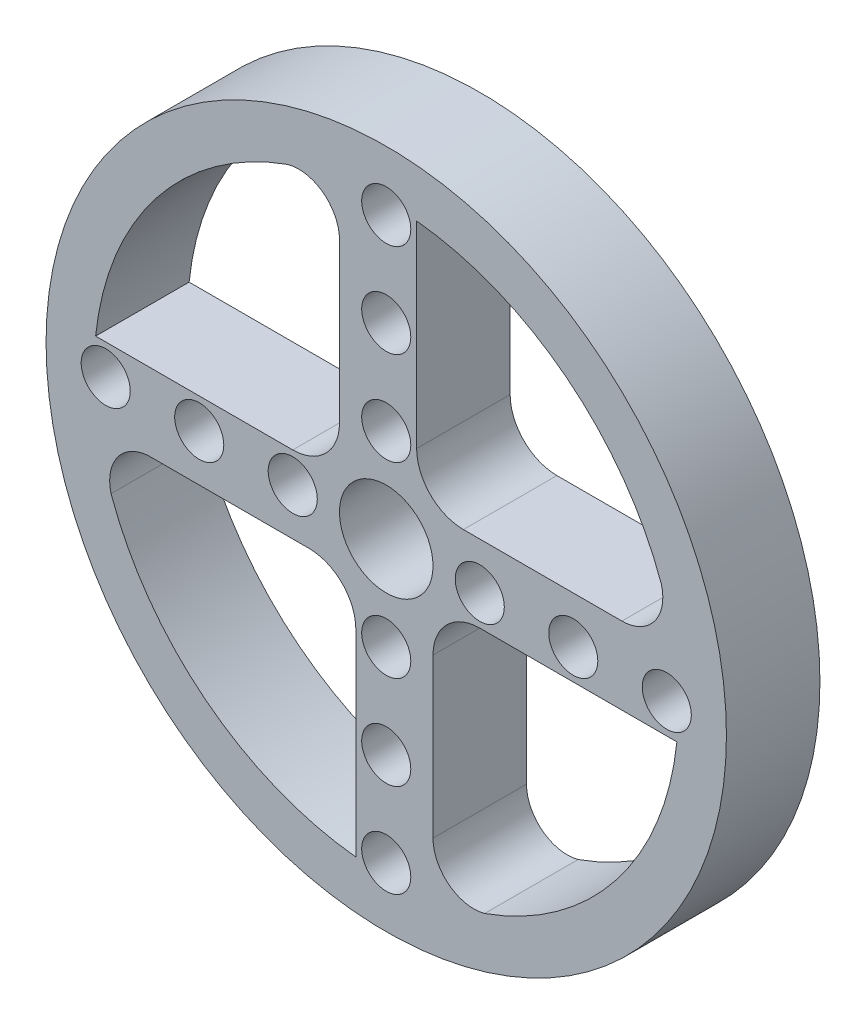
ISO-10303-21;
HEADER;
FILE_DESCRIPTION(('STEP AP214'),'2;1');
FILE_NAME('part.step','',(''),(''),'','','');
FILE_SCHEMA(('AUTOMOTIVE_DESIGN { 1 0 10303 214 1 1 1 1 }'));
ENDSEC;
DATA;
#1=APPLICATION_CONTEXT('core data for automotive mechanical design processes');
#2=APPLICATION_PROTOCOL_DEFINITION('international standard','automotive_design',2000,#1);
#3=PRODUCT_CONTEXT('',#1,'mechanical');
#4=PRODUCT('Part','Part','',(#3));
#5=PRODUCT_RELATED_PRODUCT_CATEGORY('part','',(#4));
#6=PRODUCT_DEFINITION_FORMATION('','',#4);
#7=PRODUCT_DEFINITION_CONTEXT('part definition',#1,'design');
#8=PRODUCT_DEFINITION('design','',#6,#7);
#9=PRODUCT_DEFINITION_SHAPE('','',#8);
#10=(LENGTH_UNIT() NAMED_UNIT(*) SI_UNIT(.MILLI.,.METRE.));
#11=(NAMED_UNIT(*) PLANE_ANGLE_UNIT() SI_UNIT($,.RADIAN.));
#12=(NAMED_UNIT(*) SI_UNIT($,.STERADIAN.) SOLID_ANGLE_UNIT());
#13=UNCERTAINTY_MEASURE_WITH_UNIT(LENGTH_MEASURE(1.E-05),#10,'distance_accuracy_value','');
#14=(GEOMETRIC_REPRESENTATION_CONTEXT(3) GLOBAL_UNCERTAINTY_ASSIGNED_CONTEXT((#13)) GLOBAL_UNIT_ASSIGNED_CONTEXT((#10,
#11,#12)) REPRESENTATION_CONTEXT('',''));
#15=CARTESIAN_POINT('',(0.,0.,0.));
#16=DIRECTION('',(0.,0.,1.));
#17=DIRECTION('',(1.,0.,0.));
#18=AXIS2_PLACEMENT_3D('',#15,#16,#17);
#19=CARTESIAN_POINT('',(0.,4.,8.));
#20=DIRECTION('',(0.,1.,0.));
#21=DIRECTION('',(-1.,0.,0.));
#22=AXIS2_PLACEMENT_3D('',#19,#20,#21);
#23=PLANE('',#22);
#24=DIRECTION('',(1.,0.,0.));
#25=VECTOR('',#24,1.);
#26=CARTESIAN_POINT('',(0.,4.,0.));
#27=LINE('',#26,#25);
#28=CARTESIAN_POINT('',(6.59999999999997,3.99999999999996,0.));
#29=VERTEX_POINT('',#28);
#30=CARTESIAN_POINT('',(20.1628902848437,3.99999999999986,0.));
#31=VERTEX_POINT('',#30);
#32=EDGE_CURVE('E334',#29,#31,#27,.T.);
#33=ORIENTED_EDGE('',*,*,#32,.F.);
#34=DIRECTION('',(0.,0.,-1.));
#35=VECTOR('',#34,1.);
#36=CARTESIAN_POINT('',(6.59999999999997,3.99999999999996,8.));
#37=LINE('',#36,#35);
#38=CARTESIAN_POINT('',(6.59999999999997,3.99999999999996,8.));
#39=VERTEX_POINT('',#38);
#40=EDGE_CURVE('E11',#39,#29,#37,.T.);
#41=ORIENTED_EDGE('',*,*,#40,.F.);
#42=DIRECTION('',(1.,0.,0.));
#43=VECTOR('',#42,1.);
#44=CARTESIAN_POINT('',(0.,4.,8.));
#45=LINE('',#44,#43);
#46=CARTESIAN_POINT('',(20.1628902848437,3.99999999999986,8.));
#47=VERTEX_POINT('',#46);
#48=EDGE_CURVE('E247',#39,#47,#45,.T.);
#49=ORIENTED_EDGE('',*,*,#48,.T.);
#50=DIRECTION('',(0.,0.,-1.));
#51=VECTOR('',#50,1.);
#52=CARTESIAN_POINT('',(20.1628902848437,3.99999999999986,8.));
#53=LINE('',#52,#51);
#54=EDGE_CURVE('E53',#47,#31,#53,.T.);
#55=ORIENTED_EDGE('',*,*,#54,.T.);
#56=EDGE_LOOP('',(#33,#41,#49,#55));
#57=FACE_BOUND('',#56,.T.);
#58=ADVANCED_FACE('F34',(#57),#23,.T.);
#59=CARTESIAN_POINT('',(6.6,8.00000000000002,8.));
#60=DIRECTION('',(0.,0.,-1.));
#61=DIRECTION('',(-1.,0.,0.));
#62=AXIS2_PLACEMENT_3D('',#59,#60,#61);
#63=CYLINDRICAL_SURFACE('',#62,4.);
#64=CARTESIAN_POINT('',(6.6,8.00000000000002,0.));
#65=DIRECTION('',(0.,0.,1.));
#66=DIRECTION('',(1.,0.,0.));
#67=AXIS2_PLACEMENT_3D('',#64,#65,#66);
#68=CIRCLE('',#67,4.);
#69=CARTESIAN_POINT('',(2.6,8.00000000000002,0.));
#70=VERTEX_POINT('',#69);
#71=EDGE_CURVE('E336',#70,#29,#68,.T.);
#72=ORIENTED_EDGE('',*,*,#71,.F.);
#73=DIRECTION('',(0.,0.,-1.));
#74=VECTOR('',#73,1.);
#75=CARTESIAN_POINT('',(2.6,8.00000000000002,8.));
#76=LINE('',#75,#74);
#77=CARTESIAN_POINT('',(2.6,8.00000000000002,8.));
#78=VERTEX_POINT('',#77);
#79=EDGE_CURVE('E44',#78,#70,#76,.T.);
#80=ORIENTED_EDGE('',*,*,#79,.F.);
#81=CARTESIAN_POINT('',(6.6,8.00000000000002,8.));
#82=DIRECTION('',(0.,0.,1.));
#83=DIRECTION('',(1.,0.,0.));
#84=AXIS2_PLACEMENT_3D('',#81,#82,#83);
#85=CIRCLE('',#84,4.);
#86=EDGE_CURVE('E197',#78,#39,#85,.T.);
#87=ORIENTED_EDGE('',*,*,#86,.T.);
#88=ORIENTED_EDGE('',*,*,#40,.T.);
#89=EDGE_LOOP('',(#72,#80,#87,#88));
#90=FACE_BOUND('',#89,.T.);
#91=ADVANCED_FACE('F456',(#90),#63,.F.);
#92=CARTESIAN_POINT('',(2.6,0.,8.));
#93=DIRECTION('',(1.,0.,0.));
#94=DIRECTION('',(0.,1.,0.));
#95=AXIS2_PLACEMENT_3D('',#92,#93,#94);
#96=PLANE('',#95);
#97=DIRECTION('',(0.,-1.,0.));
#98=VECTOR('',#97,1.);
#99=CARTESIAN_POINT('',(2.6,0.,0.));
#100=LINE('',#99,#98);
#101=CARTESIAN_POINT('',(2.59999999999953,24.8644324286766,0.));
#102=VERTEX_POINT('',#101);
#103=EDGE_CURVE('E183',#102,#70,#100,.T.);
#104=ORIENTED_EDGE('',*,*,#103,.F.);
#105=DIRECTION('',(0.,0.,-1.));
#106=VECTOR('',#105,1.);
#107=CARTESIAN_POINT('',(2.59999999999953,24.8644324286766,8.));
#108=LINE('',#107,#106);
#109=CARTESIAN_POINT('',(2.59999999999953,24.8644324286766,8.));
#110=VERTEX_POINT('',#109);
#111=EDGE_CURVE('E178',#110,#102,#108,.T.);
#112=ORIENTED_EDGE('',*,*,#111,.F.);
#113=DIRECTION('',(0.,-1.,0.));
#114=VECTOR('',#113,1.);
#115=CARTESIAN_POINT('',(2.6,0.,8.));
#116=LINE('',#115,#114);
#117=EDGE_CURVE('E181',#110,#78,#116,.T.);
#118=ORIENTED_EDGE('',*,*,#117,.T.);
#119=ORIENTED_EDGE('',*,*,#79,.T.);
#120=EDGE_LOOP('',(#104,#112,#118,#119));
#121=FACE_BOUND('',#120,.T.);
#122=ADVANCED_FACE('F180',(#121),#96,.T.);
#123=CARTESIAN_POINT('',(0.,0.,8.));
#124=DIRECTION('',(0.,0.,-1.));
#125=DIRECTION('',(-1.,0.,0.));
#126=AXIS2_PLACEMENT_3D('',#123,#124,#125);
#127=CYLINDRICAL_SURFACE('',#126,25.);
#128=CARTESIAN_POINT('',(0.,0.,0.));
#129=DIRECTION('',(0.,0.,1.));
#130=DIRECTION('',(1.,0.,0.));
#131=AXIS2_PLACEMENT_3D('',#128,#129,#130);
#132=CIRCLE('',#131,25.);
#133=CARTESIAN_POINT('',(23.5410982720302,8.41526542342064,0.));
#134=VERTEX_POINT('',#133);
#135=EDGE_CURVE('E305',#134,#102,#132,.T.);
#136=ORIENTED_EDGE('',*,*,#135,.F.);
#137=DIRECTION('',(0.,0.,-1.));
#138=VECTOR('',#137,1.);
#139=CARTESIAN_POINT('',(23.5410982720302,8.41526542342064,8.));
#140=LINE('',#139,#138);
#141=CARTESIAN_POINT('',(23.5410982720302,8.41526542342064,8.));
#142=VERTEX_POINT('',#141);
#143=EDGE_CURVE('E114',#142,#134,#140,.T.);
#144=ORIENTED_EDGE('',*,*,#143,.F.);
#145=CARTESIAN_POINT('',(0.,0.,8.));
#146=DIRECTION('',(0.,0.,1.));
#147=DIRECTION('',(1.,0.,0.));
#148=AXIS2_PLACEMENT_3D('',#145,#146,#147);
#149=CIRCLE('',#148,25.);
#150=EDGE_CURVE('E195',#142,#110,#149,.T.);
#151=ORIENTED_EDGE('',*,*,#150,.T.);
#152=ORIENTED_EDGE('',*,*,#111,.T.);
#153=EDGE_LOOP('',(#136,#144,#151,#152));
#154=FACE_BOUND('',#153,.T.);
#155=ADVANCED_FACE('F199',(#154),#127,.F.);
#156=CARTESIAN_POINT('',(-4.,0.,8.));
#157=DIRECTION('',(-1.,0.,0.));
#158=DIRECTION('',(0.,-1.,0.));
#159=AXIS2_PLACEMENT_3D('',#156,#157,#158);
#160=PLANE('',#159);
#161=DIRECTION('',(0.,1.,0.));
#162=VECTOR('',#161,1.);
#163=CARTESIAN_POINT('',(-4.,0.,0.));
#164=LINE('',#163,#162);
#165=CARTESIAN_POINT('',(-3.99999999999998,6.59999999999999,0.));
#166=VERTEX_POINT('',#165);
#167=CARTESIAN_POINT('',(-3.99999999999993,20.1628902848436,0.));
#168=VERTEX_POINT('',#167);
#169=EDGE_CURVE('E321',#166,#168,#164,.T.);
#170=ORIENTED_EDGE('',*,*,#169,.F.);
#171=DIRECTION('',(0.,0.,-1.));
#172=VECTOR('',#171,1.);
#173=CARTESIAN_POINT('',(-3.99999999999998,6.59999999999999,8.));
#174=LINE('',#173,#172);
#175=CARTESIAN_POINT('',(-3.99999999999998,6.59999999999999,8.));
#176=VERTEX_POINT('',#175);
#177=EDGE_CURVE('E387',#176,#166,#174,.T.);
#178=ORIENTED_EDGE('',*,*,#177,.F.);
#179=DIRECTION('',(0.,1.,0.));
#180=VECTOR('',#179,1.);
#181=CARTESIAN_POINT('',(-4.,0.,8.));
#182=LINE('',#181,#180);
#183=CARTESIAN_POINT('',(-3.99999999999993,20.1628902848436,8.));
#184=VERTEX_POINT('',#183);
#185=EDGE_CURVE('E227',#176,#184,#182,.T.);
#186=ORIENTED_EDGE('',*,*,#185,.T.);
#187=DIRECTION('',(0.,0.,-1.));
#188=VECTOR('',#187,1.);
#189=CARTESIAN_POINT('',(-3.99999999999993,20.1628902848436,8.));
#190=LINE('',#189,#188);
#191=EDGE_CURVE('E390',#184,#168,#190,.T.);
#192=ORIENTED_EDGE('',*,*,#191,.T.);
#193=EDGE_LOOP('',(#170,#178,#186,#192));
#194=FACE_BOUND('',#193,.T.);
#195=ADVANCED_FACE('F454',(#194),#160,.T.);
#196=CARTESIAN_POINT('',(-8.,6.6,8.));
#197=DIRECTION('',(0.,0.,-1.));
#198=DIRECTION('',(-1.,0.,0.));
#199=AXIS2_PLACEMENT_3D('',#196,#197,#198);
#200=CYLINDRICAL_SURFACE('',#199,4.);
#201=CARTESIAN_POINT('',(-8.,6.6,0.));
#202=DIRECTION('',(0.,0.,1.));
#203=DIRECTION('',(1.,0.,0.));
#204=AXIS2_PLACEMENT_3D('',#201,#202,#203);
#205=CIRCLE('',#204,4.);
#206=CARTESIAN_POINT('',(-8.,2.6,0.));
#207=VERTEX_POINT('',#206);
#208=EDGE_CURVE('E324',#207,#166,#205,.T.);
#209=ORIENTED_EDGE('',*,*,#208,.F.);
#210=DIRECTION('',(0.,0.,-1.));
#211=VECTOR('',#210,1.);
#212=CARTESIAN_POINT('',(-8.,2.6,8.));
#213=LINE('',#212,#211);
#214=CARTESIAN_POINT('',(-8.,2.6,8.));
#215=VERTEX_POINT('',#214);
#216=EDGE_CURVE('E397',#215,#207,#213,.T.);
#217=ORIENTED_EDGE('',*,*,#216,.F.);
#218=CARTESIAN_POINT('',(-8.,6.6,8.));
#219=DIRECTION('',(0.,0.,1.));
#220=DIRECTION('',(1.,0.,0.));
#221=AXIS2_PLACEMENT_3D('',#218,#219,#220);
#222=CIRCLE('',#221,4.);
#223=EDGE_CURVE('E240',#215,#176,#222,.T.);
#224=ORIENTED_EDGE('',*,*,#223,.T.);
#225=ORIENTED_EDGE('',*,*,#177,.T.);
#226=EDGE_LOOP('',(#209,#217,#224,#225));
#227=FACE_BOUND('',#226,.T.);
#228=ADVANCED_FACE('F473',(#227),#200,.F.);
#229=CARTESIAN_POINT('',(0.,2.6,8.));
#230=DIRECTION('',(0.,1.,0.));
#231=DIRECTION('',(0.,0.,1.));
#232=AXIS2_PLACEMENT_3D('',#229,#230,#231);
#233=PLANE('',#232);
#234=DIRECTION('',(1.,0.,0.));
#235=VECTOR('',#234,1.);
#236=CARTESIAN_POINT('',(0.,2.6,0.));
#237=LINE('',#236,#235);
#238=CARTESIAN_POINT('',(-24.8644324286766,2.59999999999954,0.));
#239=VERTEX_POINT('',#238);
#240=EDGE_CURVE('E327',#239,#207,#237,.T.);
#241=ORIENTED_EDGE('',*,*,#240,.F.);
#242=DIRECTION('',(0.,0.,-1.));
#243=VECTOR('',#242,1.);
#244=CARTESIAN_POINT('',(-24.8644324286766,2.59999999999954,8.));
#245=LINE('',#244,#243);
#246=CARTESIAN_POINT('',(-24.8644324286766,2.59999999999954,8.));
#247=VERTEX_POINT('',#246);
#248=EDGE_CURVE('E395',#247,#239,#245,.T.);
#249=ORIENTED_EDGE('',*,*,#248,.F.);
#250=DIRECTION('',(1.,0.,0.));
#251=VECTOR('',#250,1.);
#252=CARTESIAN_POINT('',(0.,2.6,8.));
#253=LINE('',#252,#251);
#254=EDGE_CURVE('E210',#247,#215,#253,.T.);
#255=ORIENTED_EDGE('',*,*,#254,.T.);
#256=ORIENTED_EDGE('',*,*,#216,.T.);
#257=EDGE_LOOP('',(#241,#249,#255,#256));
#258=FACE_BOUND('',#257,.T.);
#259=ADVANCED_FACE('F470',(#258),#233,.T.);
#260=CARTESIAN_POINT('',(-8.41526542342072,23.5410982720301,0.));
#261=VERTEX_POINT('',#260);
#262=EDGE_CURVE('E330',#261,#239,#132,.T.);
#263=ORIENTED_EDGE('',*,*,#262,.F.);
#264=DIRECTION('',(0.,0.,-1.));
#265=VECTOR('',#264,1.);
#266=CARTESIAN_POINT('',(-8.41526542342072,23.5410982720301,8.));
#267=LINE('',#266,#265);
#268=CARTESIAN_POINT('',(-8.41526542342072,23.5410982720301,8.));
#269=VERTEX_POINT('',#268);
#270=EDGE_CURVE('E392',#269,#261,#267,.T.);
#271=ORIENTED_EDGE('',*,*,#270,.F.);
#272=EDGE_CURVE('E202',#269,#247,#149,.T.);
#273=ORIENTED_EDGE('',*,*,#272,.T.);
#274=ORIENTED_EDGE('',*,*,#248,.T.);
#275=EDGE_LOOP('',(#263,#271,#273,#274));
#276=FACE_BOUND('',#275,.T.);
#277=ADVANCED_FACE('F452',(#276),#127,.F.);
#278=CARTESIAN_POINT('',(0.,-4.,8.));
#279=DIRECTION('',(0.,-1.,0.));
#280=DIRECTION('',(1.,0.,0.));
#281=AXIS2_PLACEMENT_3D('',#278,#279,#280);
#282=PLANE('',#281);
#283=DIRECTION('',(-1.,0.,0.));
#284=VECTOR('',#283,1.);
#285=CARTESIAN_POINT('',(0.,-4.,0.));
#286=LINE('',#285,#284);
#287=CARTESIAN_POINT('',(-6.59999999999998,-4.,0.));
#288=VERTEX_POINT('',#287);
#289=CARTESIAN_POINT('',(-20.1628902848436,-4.,0.));
#290=VERTEX_POINT('',#289);
#291=EDGE_CURVE('E309',#288,#290,#286,.T.);
#292=ORIENTED_EDGE('',*,*,#291,.F.);
#293=DIRECTION('',(0.,0.,-1.));
#294=VECTOR('',#293,1.);
#295=CARTESIAN_POINT('',(-6.59999999999998,-4.,8.));
#296=LINE('',#295,#294);
#297=CARTESIAN_POINT('',(-6.59999999999998,-4.,8.));
#298=VERTEX_POINT('',#297);
#299=EDGE_CURVE('E393',#298,#288,#296,.T.);
#300=ORIENTED_EDGE('',*,*,#299,.F.);
#301=DIRECTION('',(-1.,0.,0.));
#302=VECTOR('',#301,1.);
#303=CARTESIAN_POINT('',(0.,-4.,8.));
#304=LINE('',#303,#302);
#305=CARTESIAN_POINT('',(-20.1628902848436,-4.,8.));
#306=VERTEX_POINT('',#305);
#307=EDGE_CURVE('E218',#298,#306,#304,.T.);
#308=ORIENTED_EDGE('',*,*,#307,.T.);
#309=DIRECTION('',(0.,0.,-1.));
#310=VECTOR('',#309,1.);
#311=CARTESIAN_POINT('',(-20.1628902848436,-4.,8.));
#312=LINE('',#311,#310);
#313=EDGE_CURVE('E400',#306,#290,#312,.T.);
#314=ORIENTED_EDGE('',*,*,#313,.T.);
#315=EDGE_LOOP('',(#292,#300,#308,#314));
#316=FACE_BOUND('',#315,.T.);
#317=ADVANCED_FACE('F489',(#316),#282,.T.);
#318=CARTESIAN_POINT('',(-6.59999999999998,-8.,8.));
#319=DIRECTION('',(0.,0.,-1.));
#320=DIRECTION('',(-1.,0.,0.));
#321=AXIS2_PLACEMENT_3D('',#318,#319,#320);
#322=CYLINDRICAL_SURFACE('',#321,4.);
#323=CARTESIAN_POINT('',(-6.59999999999998,-8.,0.));
#324=DIRECTION('',(0.,0.,1.));
#325=DIRECTION('',(1.,0.,0.));
#326=AXIS2_PLACEMENT_3D('',#323,#324,#325);
#327=CIRCLE('',#326,4.);
#328=CARTESIAN_POINT('',(-2.59999999999998,-8.,0.));
#329=VERTEX_POINT('',#328);
#330=EDGE_CURVE('E312',#329,#288,#327,.T.);
#331=ORIENTED_EDGE('',*,*,#330,.F.);
#332=DIRECTION('',(0.,0.,-1.));
#333=VECTOR('',#332,1.);
#334=CARTESIAN_POINT('',(-2.59999999999998,-8.,8.));
#335=LINE('',#334,#333);
#336=CARTESIAN_POINT('',(-2.59999999999998,-8.,8.));
#337=VERTEX_POINT('',#336);
#338=EDGE_CURVE('E406',#337,#329,#335,.T.);
#339=ORIENTED_EDGE('',*,*,#338,.F.);
#340=CARTESIAN_POINT('',(-6.59999999999998,-8.,8.));
#341=DIRECTION('',(0.,0.,1.));
#342=DIRECTION('',(1.,0.,0.));
#343=AXIS2_PLACEMENT_3D('',#340,#341,#342);
#344=CIRCLE('',#343,4.);
#345=EDGE_CURVE('E230',#337,#298,#344,.T.);
#346=ORIENTED_EDGE('',*,*,#345,.T.);
#347=ORIENTED_EDGE('',*,*,#299,.T.);
#348=EDGE_LOOP('',(#331,#339,#346,#347));
#349=FACE_BOUND('',#348,.T.);
#350=ADVANCED_FACE('F486',(#349),#322,.F.);
#351=CARTESIAN_POINT('',(-2.59999999999998,0.,8.));
#352=DIRECTION('',(-1.,0.,0.));
#353=DIRECTION('',(0.,-1.,0.));
#354=AXIS2_PLACEMENT_3D('',#351,#352,#353);
#355=PLANE('',#354);
#356=DIRECTION('',(0.,1.,0.));
#357=VECTOR('',#356,1.);
#358=CARTESIAN_POINT('',(-2.59999999999998,0.,0.));
#359=LINE('',#358,#357);
#360=CARTESIAN_POINT('',(-2.59999999999951,-24.8644324286766,0.));
#361=VERTEX_POINT('',#360);
#362=EDGE_CURVE('E315',#361,#329,#359,.T.);
#363=ORIENTED_EDGE('',*,*,#362,.F.);
#364=DIRECTION('',(0.,0.,-1.));
#365=VECTOR('',#364,1.);
#366=CARTESIAN_POINT('',(-2.59999999999951,-24.8644324286766,8.));
#367=LINE('',#366,#365);
#368=CARTESIAN_POINT('',(-2.59999999999951,-24.8644324286766,8.));
#369=VERTEX_POINT('',#368);
#370=EDGE_CURVE('E404',#369,#361,#367,.T.);
#371=ORIENTED_EDGE('',*,*,#370,.F.);
#372=DIRECTION('',(0.,1.,0.));
#373=VECTOR('',#372,1.);
#374=CARTESIAN_POINT('',(-2.59999999999998,0.,8.));
#375=LINE('',#374,#373);
#376=EDGE_CURVE('E223',#369,#337,#375,.T.);
#377=ORIENTED_EDGE('',*,*,#376,.T.);
#378=ORIENTED_EDGE('',*,*,#338,.T.);
#379=EDGE_LOOP('',(#363,#371,#377,#378));
#380=FACE_BOUND('',#379,.T.);
#381=ADVANCED_FACE('F451',(#380),#355,.T.);
#382=CARTESIAN_POINT('',(-23.5410982720301,-8.4152654234208,0.));
#383=VERTEX_POINT('',#382);
#384=EDGE_CURVE('E306',#383,#361,#132,.T.);
#385=ORIENTED_EDGE('',*,*,#384,.F.);
#386=DIRECTION('',(0.,0.,-1.));
#387=VECTOR('',#386,1.);
#388=CARTESIAN_POINT('',(-23.5410982720301,-8.4152654234208,8.));
#389=LINE('',#388,#387);
#390=CARTESIAN_POINT('',(-23.5410982720301,-8.4152654234208,8.));
#391=VERTEX_POINT('',#390);
#392=EDGE_CURVE('E402',#391,#383,#389,.T.);
#393=ORIENTED_EDGE('',*,*,#392,.F.);
#394=EDGE_CURVE('E211',#391,#369,#149,.T.);
#395=ORIENTED_EDGE('',*,*,#394,.T.);
#396=ORIENTED_EDGE('',*,*,#370,.T.);
#397=EDGE_LOOP('',(#385,#393,#395,#396));
#398=FACE_BOUND('',#397,.T.);
#399=ADVANCED_FACE('F439',(#398),#127,.F.);
#400=CARTESIAN_POINT('',(4.,0.,8.));
#401=DIRECTION('',(1.,0.,0.));
#402=DIRECTION('',(0.,1.,0.));
#403=AXIS2_PLACEMENT_3D('',#400,#401,#402);
#404=PLANE('',#403);
#405=DIRECTION('',(0.,-1.,0.));
#406=VECTOR('',#405,1.);
#407=CARTESIAN_POINT('',(4.,0.,0.));
#408=LINE('',#407,#406);
#409=CARTESIAN_POINT('',(3.99999999999993,-6.59999999999993,0.));
#410=VERTEX_POINT('',#409);
#411=CARTESIAN_POINT('',(3.99999999999979,-20.1628902848437,0.));
#412=VERTEX_POINT('',#411);
#413=EDGE_CURVE('E292',#410,#412,#408,.T.);
#414=ORIENTED_EDGE('',*,*,#413,.F.);
#415=DIRECTION('',(0.,0.,-1.));
#416=VECTOR('',#415,1.);
#417=CARTESIAN_POINT('',(3.99999999999993,-6.59999999999993,8.));
#418=LINE('',#417,#416);
#419=CARTESIAN_POINT('',(3.99999999999993,-6.59999999999993,8.));
#420=VERTEX_POINT('',#419);
#421=EDGE_CURVE('E38',#420,#410,#418,.T.);
#422=ORIENTED_EDGE('',*,*,#421,.F.);
#423=DIRECTION('',(0.,-1.,0.));
#424=VECTOR('',#423,1.);
#425=CARTESIAN_POINT('',(4.,0.,8.));
#426=LINE('',#425,#424);
#427=CARTESIAN_POINT('',(3.99999999999979,-20.1628902848437,8.));
#428=VERTEX_POINT('',#427);
#429=EDGE_CURVE('E385',#420,#428,#426,.T.);
#430=ORIENTED_EDGE('',*,*,#429,.T.);
#431=DIRECTION('',(0.,0.,-1.));
#432=VECTOR('',#431,1.);
#433=CARTESIAN_POINT('',(3.99999999999979,-20.1628902848437,8.));
#434=LINE('',#433,#432);
#435=EDGE_CURVE('E291',#428,#412,#434,.T.);
#436=ORIENTED_EDGE('',*,*,#435,.T.);
#437=EDGE_LOOP('',(#414,#422,#430,#436));
#438=FACE_BOUND('',#437,.T.);
#439=ADVANCED_FACE('F36',(#438),#404,.T.);
#440=CARTESIAN_POINT('',(8.00000000000002,-6.59999999999997,8.));
#441=DIRECTION('',(0.,0.,-1.));
#442=DIRECTION('',(-1.,0.,0.));
#443=AXIS2_PLACEMENT_3D('',#440,#441,#442);
#444=CYLINDRICAL_SURFACE('',#443,4.);
#445=CARTESIAN_POINT('',(8.00000000000002,-6.59999999999997,0.));
#446=DIRECTION('',(0.,0.,1.));
#447=DIRECTION('',(1.,0.,0.));
#448=AXIS2_PLACEMENT_3D('',#445,#446,#447);
#449=CIRCLE('',#448,4.);
#450=CARTESIAN_POINT('',(8.00000000000002,-2.59999999999997,0.));
#451=VERTEX_POINT('',#450);
#452=EDGE_CURVE('E295',#451,#410,#449,.T.);
#453=ORIENTED_EDGE('',*,*,#452,.F.);
#454=DIRECTION('',(0.,0.,-1.));
#455=VECTOR('',#454,1.);
#456=CARTESIAN_POINT('',(8.00000000000002,-2.59999999999997,8.));
#457=LINE('',#456,#455);
#458=CARTESIAN_POINT('',(8.00000000000002,-2.59999999999997,8.));
#459=VERTEX_POINT('',#458);
#460=EDGE_CURVE('E413',#459,#451,#457,.T.);
#461=ORIENTED_EDGE('',*,*,#460,.F.);
#462=CARTESIAN_POINT('',(8.00000000000002,-6.59999999999997,8.));
#463=DIRECTION('',(0.,0.,1.));
#464=DIRECTION('',(1.,0.,0.));
#465=AXIS2_PLACEMENT_3D('',#462,#463,#464);
#466=CIRCLE('',#465,4.);
#467=EDGE_CURVE('E220',#459,#420,#466,.T.);
#468=ORIENTED_EDGE('',*,*,#467,.T.);
#469=ORIENTED_EDGE('',*,*,#421,.T.);
#470=EDGE_LOOP('',(#453,#461,#468,#469));
#471=FACE_BOUND('',#470,.T.);
#472=ADVANCED_FACE('F419',(#471),#444,.F.);
#473=CARTESIAN_POINT('',(0.,-2.59999999999998,8.));
#474=DIRECTION('',(0.,-1.,0.));
#475=DIRECTION('',(1.,0.,0.));
#476=AXIS2_PLACEMENT_3D('',#473,#474,#475);
#477=PLANE('',#476);
#478=DIRECTION('',(-1.,0.,0.));
#479=VECTOR('',#478,1.);
#480=CARTESIAN_POINT('',(0.,-2.59999999999998,0.));
#481=LINE('',#480,#479);
#482=CARTESIAN_POINT('',(24.8644324286766,-2.59999999999951,0.));
#483=VERTEX_POINT('',#482);
#484=EDGE_CURVE('E298',#483,#451,#481,.T.);
#485=ORIENTED_EDGE('',*,*,#484,.F.);
#486=DIRECTION('',(0.,0.,-1.));
#487=VECTOR('',#486,1.);
#488=CARTESIAN_POINT('',(24.8644324286766,-2.59999999999951,8.));
#489=LINE('',#488,#487);
#490=CARTESIAN_POINT('',(24.8644324286766,-2.59999999999951,8.));
#491=VERTEX_POINT('',#490);
#492=EDGE_CURVE('E412',#491,#483,#489,.T.);
#493=ORIENTED_EDGE('',*,*,#492,.F.);
#494=DIRECTION('',(-1.,0.,0.));
#495=VECTOR('',#494,1.);
#496=CARTESIAN_POINT('',(0.,-2.59999999999998,8.));
#497=LINE('',#496,#495);
#498=EDGE_CURVE('E214',#491,#459,#497,.T.);
#499=ORIENTED_EDGE('',*,*,#498,.T.);
#500=ORIENTED_EDGE('',*,*,#460,.T.);
#501=EDGE_LOOP('',(#485,#493,#499,#500));
#502=FACE_BOUND('',#501,.T.);
#503=ADVANCED_FACE('F426',(#502),#477,.T.);
#504=CARTESIAN_POINT('',(8.41526542342056,-23.5410982720302,0.));
#505=VERTEX_POINT('',#504);
#506=EDGE_CURVE('E301',#505,#483,#132,.T.);
#507=ORIENTED_EDGE('',*,*,#506,.F.);
#508=DIRECTION('',(0.,0.,-1.));
#509=VECTOR('',#508,1.);
#510=CARTESIAN_POINT('',(8.41526542342056,-23.5410982720302,8.));
#511=LINE('',#510,#509);
#512=CARTESIAN_POINT('',(8.41526542342056,-23.5410982720302,8.));
#513=VERTEX_POINT('',#512);
#514=EDGE_CURVE('E410',#513,#505,#511,.T.);
#515=ORIENTED_EDGE('',*,*,#514,.F.);
#516=EDGE_CURVE('E203',#513,#491,#149,.T.);
#517=ORIENTED_EDGE('',*,*,#516,.T.);
#518=ORIENTED_EDGE('',*,*,#492,.T.);
#519=EDGE_LOOP('',(#507,#515,#517,#518));
#520=FACE_BOUND('',#519,.T.);
#521=ADVANCED_FACE('F435',(#520),#127,.F.);
#522=CARTESIAN_POINT('',(8.,0.,8.));
#523=DIRECTION('',(0.,0.,-1.));
#524=DIRECTION('',(-1.,0.,0.));
#525=AXIS2_PLACEMENT_3D('',#522,#523,#524);
#526=CYLINDRICAL_SURFACE('',#525,2.1);
#527=CARTESIAN_POINT('',(8.,0.,8.));
#528=DIRECTION('',(0.,0.,1.));
#529=DIRECTION('',(1.,0.,0.));
#530=AXIS2_PLACEMENT_3D('',#527,#528,#529);
#531=CIRCLE('',#530,2.1);
#532=CARTESIAN_POINT('',(10.1,0.,8.));
#533=VERTEX_POINT('',#532);
#534=EDGE_CURVE('E285',#533,#533,#531,.T.);
#535=ORIENTED_EDGE('',*,*,#534,.T.);
#536=EDGE_LOOP('',(#535));
#537=FACE_BOUND('',#536,.T.);
#538=CARTESIAN_POINT('',(8.,0.,0.));
#539=DIRECTION('',(0.,0.,1.));
#540=DIRECTION('',(1.,0.,0.));
#541=AXIS2_PLACEMENT_3D('',#538,#539,#540);
#542=CIRCLE('',#541,2.1);
#543=CARTESIAN_POINT('',(10.1,0.,0.));
#544=VERTEX_POINT('',#543);
#545=EDGE_CURVE('E379',#544,#544,#542,.T.);
#546=ORIENTED_EDGE('',*,*,#545,.F.);
#547=EDGE_LOOP('',(#546));
#548=FACE_BOUND('',#547,.T.);
#549=ADVANCED_FACE('F437',(#537,#548),#526,.F.);
#550=CARTESIAN_POINT('',(0.,-8.,8.));
#551=DIRECTION('',(0.,0.,-1.));
#552=DIRECTION('',(-1.,0.,0.));
#553=AXIS2_PLACEMENT_3D('',#550,#551,#552);
#554=CYLINDRICAL_SURFACE('',#553,2.1);
#555=CARTESIAN_POINT('',(0.,-8.,8.));
#556=DIRECTION('',(0.,0.,1.));
#557=DIRECTION('',(1.,0.,0.));
#558=AXIS2_PLACEMENT_3D('',#555,#556,#557);
#559=CIRCLE('',#558,2.1);
#560=CARTESIAN_POINT('',(2.1,-8.,8.));
#561=VERTEX_POINT('',#560);
#562=EDGE_CURVE('E282',#561,#561,#559,.T.);
#563=ORIENTED_EDGE('',*,*,#562,.T.);
#564=EDGE_LOOP('',(#563));
#565=FACE_BOUND('',#564,.T.);
#566=CARTESIAN_POINT('',(0.,-8.,0.));
#567=DIRECTION('',(0.,0.,1.));
#568=DIRECTION('',(1.,0.,0.));
#569=AXIS2_PLACEMENT_3D('',#566,#567,#568);
#570=CIRCLE('',#569,2.1);
#571=CARTESIAN_POINT('',(2.1,-8.,0.));
#572=VERTEX_POINT('',#571);
#573=EDGE_CURVE('E376',#572,#572,#570,.T.);
#574=ORIENTED_EDGE('',*,*,#573,.F.);
#575=EDGE_LOOP('',(#574));
#576=FACE_BOUND('',#575,.T.);
#577=ADVANCED_FACE('F444',(#565,#576),#554,.F.);
#578=CARTESIAN_POINT('',(0.,-16.,8.));
#579=DIRECTION('',(0.,0.,-1.));
#580=DIRECTION('',(-1.,0.,0.));
#581=AXIS2_PLACEMENT_3D('',#578,#579,#580);
#582=CYLINDRICAL_SURFACE('',#581,2.1);
#583=CARTESIAN_POINT('',(0.,-16.,8.));
#584=DIRECTION('',(0.,0.,1.));
#585=DIRECTION('',(1.,0.,0.));
#586=AXIS2_PLACEMENT_3D('',#583,#584,#585);
#587=CIRCLE('',#586,2.1);
#588=CARTESIAN_POINT('',(2.1,-16.,8.));
#589=VERTEX_POINT('',#588);
#590=EDGE_CURVE('E279',#589,#589,#587,.T.);
#591=ORIENTED_EDGE('',*,*,#590,.T.);
#592=EDGE_LOOP('',(#591));
#593=FACE_BOUND('',#592,.T.);
#594=CARTESIAN_POINT('',(0.,-16.,0.));
#595=DIRECTION('',(0.,0.,1.));
#596=DIRECTION('',(1.,0.,0.));
#597=AXIS2_PLACEMENT_3D('',#594,#595,#596);
#598=CIRCLE('',#597,2.1);
#599=CARTESIAN_POINT('',(2.1,-16.,0.));
#600=VERTEX_POINT('',#599);
#601=EDGE_CURVE('E373',#600,#600,#598,.T.);
#602=ORIENTED_EDGE('',*,*,#601,.F.);
#603=EDGE_LOOP('',(#602));
#604=FACE_BOUND('',#603,.T.);
#605=ADVANCED_FACE('F603',(#593,#604),#582,.F.);
#606=CARTESIAN_POINT('',(0.,16.,8.));
#607=DIRECTION('',(0.,0.,-1.));
#608=DIRECTION('',(-1.,0.,0.));
#609=AXIS2_PLACEMENT_3D('',#606,#607,#608);
#610=CYLINDRICAL_SURFACE('',#609,2.1);
#611=CARTESIAN_POINT('',(0.,16.,8.));
#612=DIRECTION('',(0.,0.,1.));
#613=DIRECTION('',(1.,0.,0.));
#614=AXIS2_PLACEMENT_3D('',#611,#612,#613);
#615=CIRCLE('',#614,2.1);
#616=CARTESIAN_POINT('',(2.1,16.,8.));
#617=VERTEX_POINT('',#616);
#618=EDGE_CURVE('E276',#617,#617,#615,.T.);
#619=ORIENTED_EDGE('',*,*,#618,.T.);
#620=EDGE_LOOP('',(#619));
#621=FACE_BOUND('',#620,.T.);
#622=CARTESIAN_POINT('',(0.,16.,0.));
#623=DIRECTION('',(0.,0.,1.));
#624=DIRECTION('',(1.,0.,0.));
#625=AXIS2_PLACEMENT_3D('',#622,#623,#624);
#626=CIRCLE('',#625,2.1);
#627=CARTESIAN_POINT('',(2.1,16.,0.));
#628=VERTEX_POINT('',#627);
#629=EDGE_CURVE('E370',#628,#628,#626,.T.);
#630=ORIENTED_EDGE('',*,*,#629,.F.);
#631=EDGE_LOOP('',(#630));
#632=FACE_BOUND('',#631,.T.);
#633=ADVANCED_FACE('F612',(#621,#632),#610,.F.);
#634=CARTESIAN_POINT('',(0.,8.,8.));
#635=DIRECTION('',(0.,0.,-1.));
#636=DIRECTION('',(-1.,0.,0.));
#637=AXIS2_PLACEMENT_3D('',#634,#635,#636);
#638=CYLINDRICAL_SURFACE('',#637,2.1);
#639=CARTESIAN_POINT('',(0.,8.,8.));
#640=DIRECTION('',(0.,0.,1.));
#641=DIRECTION('',(1.,0.,0.));
#642=AXIS2_PLACEMENT_3D('',#639,#640,#641);
#643=CIRCLE('',#642,2.1);
#644=CARTESIAN_POINT('',(2.1,8.,8.));
#645=VERTEX_POINT('',#644);
#646=EDGE_CURVE('E273',#645,#645,#643,.T.);
#647=ORIENTED_EDGE('',*,*,#646,.T.);
#648=EDGE_LOOP('',(#647));
#649=FACE_BOUND('',#648,.T.);
#650=CARTESIAN_POINT('',(0.,8.,0.));
#651=DIRECTION('',(0.,0.,1.));
#652=DIRECTION('',(1.,0.,0.));
#653=AXIS2_PLACEMENT_3D('',#650,#651,#652);
#654=CIRCLE('',#653,2.1);
#655=CARTESIAN_POINT('',(2.1,8.,0.));
#656=VERTEX_POINT('',#655);
#657=EDGE_CURVE('E367',#656,#656,#654,.T.);
#658=ORIENTED_EDGE('',*,*,#657,.F.);
#659=EDGE_LOOP('',(#658));
#660=FACE_BOUND('',#659,.T.);
#661=ADVANCED_FACE('F621',(#649,#660),#638,.F.);
#662=CARTESIAN_POINT('',(-16.,0.,8.));
#663=DIRECTION('',(0.,0.,-1.));
#664=DIRECTION('',(-1.,0.,0.));
#665=AXIS2_PLACEMENT_3D('',#662,#663,#664);
#666=CYLINDRICAL_SURFACE('',#665,2.1);
#667=CARTESIAN_POINT('',(-16.,0.,8.));
#668=DIRECTION('',(0.,0.,1.));
#669=DIRECTION('',(1.,0.,0.));
#670=AXIS2_PLACEMENT_3D('',#667,#668,#669);
#671=CIRCLE('',#670,2.1);
#672=CARTESIAN_POINT('',(-13.9,0.,8.));
#673=VERTEX_POINT('',#672);
#674=EDGE_CURVE('E270',#673,#673,#671,.T.);
#675=ORIENTED_EDGE('',*,*,#674,.T.);
#676=EDGE_LOOP('',(#675));
#677=FACE_BOUND('',#676,.T.);
#678=CARTESIAN_POINT('',(-16.,0.,0.));
#679=DIRECTION('',(0.,0.,1.));
#680=DIRECTION('',(1.,0.,0.));
#681=AXIS2_PLACEMENT_3D('',#678,#679,#680);
#682=CIRCLE('',#681,2.1);
#683=CARTESIAN_POINT('',(-13.9,0.,0.));
#684=VERTEX_POINT('',#683);
#685=EDGE_CURVE('E364',#684,#684,#682,.T.);
#686=ORIENTED_EDGE('',*,*,#685,.F.);
#687=EDGE_LOOP('',(#686));
#688=FACE_BOUND('',#687,.T.);
#689=ADVANCED_FACE('F630',(#677,#688),#666,.F.);
#690=CARTESIAN_POINT('',(-8.,0.,8.));
#691=DIRECTION('',(0.,0.,-1.));
#692=DIRECTION('',(-1.,0.,0.));
#693=AXIS2_PLACEMENT_3D('',#690,#691,#692);
#694=CYLINDRICAL_SURFACE('',#693,2.1);
#695=CARTESIAN_POINT('',(-8.,0.,8.));
#696=DIRECTION('',(0.,0.,1.));
#697=DIRECTION('',(1.,0.,0.));
#698=AXIS2_PLACEMENT_3D('',#695,#696,#697);
#699=CIRCLE('',#698,2.1);
#700=CARTESIAN_POINT('',(-5.9,0.,8.));
#701=VERTEX_POINT('',#700);
#702=EDGE_CURVE('E267',#701,#701,#699,.T.);
#703=ORIENTED_EDGE('',*,*,#702,.T.);
#704=EDGE_LOOP('',(#703));
#705=FACE_BOUND('',#704,.T.);
#706=CARTESIAN_POINT('',(-8.,0.,0.));
#707=DIRECTION('',(0.,0.,1.));
#708=DIRECTION('',(1.,0.,0.));
#709=AXIS2_PLACEMENT_3D('',#706,#707,#708);
#710=CIRCLE('',#709,2.1);
#711=CARTESIAN_POINT('',(-5.9,0.,0.));
#712=VERTEX_POINT('',#711);
#713=EDGE_CURVE('E361',#712,#712,#710,.T.);
#714=ORIENTED_EDGE('',*,*,#713,.F.);
#715=EDGE_LOOP('',(#714));
#716=FACE_BOUND('',#715,.T.);
#717=ADVANCED_FACE('F639',(#705,#716),#694,.F.);
#718=CARTESIAN_POINT('',(0.,0.,8.));
#719=DIRECTION('',(0.,0.,-1.));
#720=DIRECTION('',(-1.,0.,0.));
#721=AXIS2_PLACEMENT_3D('',#718,#719,#720);
#722=CYLINDRICAL_SURFACE('',#721,29.105);
#723=CARTESIAN_POINT('',(0.,0.,8.));
#724=DIRECTION('',(0.,0.,1.));
#725=DIRECTION('',(1.,0.,0.));
#726=AXIS2_PLACEMENT_3D('',#723,#724,#725);
#727=CIRCLE('',#726,29.105);
#728=CARTESIAN_POINT('',(29.105,0.,8.));
#729=VERTEX_POINT('',#728);
#730=EDGE_CURVE('E264',#729,#729,#727,.T.);
#731=ORIENTED_EDGE('',*,*,#730,.F.);
#732=EDGE_LOOP('',(#731));
#733=FACE_BOUND('',#732,.T.);
#734=CARTESIAN_POINT('',(0.,0.,0.));
#735=DIRECTION('',(0.,0.,1.));
#736=DIRECTION('',(1.,0.,0.));
#737=AXIS2_PLACEMENT_3D('',#734,#735,#736);
#738=CIRCLE('',#737,29.105);
#739=CARTESIAN_POINT('',(29.105,0.,0.));
#740=VERTEX_POINT('',#739);
#741=EDGE_CURVE('E358',#740,#740,#738,.T.);
#742=ORIENTED_EDGE('',*,*,#741,.T.);
#743=EDGE_LOOP('',(#742));
#744=FACE_BOUND('',#743,.T.);
#745=ADVANCED_FACE('F648',(#733,#744),#722,.T.);
#746=CARTESIAN_POINT('',(-24.,0.,8.));
#747=DIRECTION('',(0.,0.,-1.));
#748=DIRECTION('',(-1.,0.,0.));
#749=AXIS2_PLACEMENT_3D('',#746,#747,#748);
#750=CYLINDRICAL_SURFACE('',#749,2.1);
#751=CARTESIAN_POINT('',(-24.,0.,8.));
#752=DIRECTION('',(0.,0.,1.));
#753=DIRECTION('',(1.,0.,0.));
#754=AXIS2_PLACEMENT_3D('',#751,#752,#753);
#755=CIRCLE('',#754,2.1);
#756=CARTESIAN_POINT('',(-21.9,0.,8.));
#757=VERTEX_POINT('',#756);
#758=EDGE_CURVE('E261',#757,#757,#755,.T.);
#759=ORIENTED_EDGE('',*,*,#758,.T.);
#760=EDGE_LOOP('',(#759));
#761=FACE_BOUND('',#760,.T.);
#762=CARTESIAN_POINT('',(-24.,0.,0.));
#763=DIRECTION('',(0.,0.,1.));
#764=DIRECTION('',(1.,0.,0.));
#765=AXIS2_PLACEMENT_3D('',#762,#763,#764);
#766=CIRCLE('',#765,2.1);
#767=CARTESIAN_POINT('',(-21.9,0.,0.));
#768=VERTEX_POINT('',#767);
#769=EDGE_CURVE('E355',#768,#768,#766,.T.);
#770=ORIENTED_EDGE('',*,*,#769,.F.);
#771=EDGE_LOOP('',(#770));
#772=FACE_BOUND('',#771,.T.);
#773=ADVANCED_FACE('F657',(#761,#772),#750,.F.);
#774=CARTESIAN_POINT('',(0.,-24.,8.));
#775=DIRECTION('',(0.,0.,-1.));
#776=DIRECTION('',(-1.,0.,0.));
#777=AXIS2_PLACEMENT_3D('',#774,#775,#776);
#778=CYLINDRICAL_SURFACE('',#777,2.1);
#779=CARTESIAN_POINT('',(0.,-24.,8.));
#780=DIRECTION('',(0.,0.,1.));
#781=DIRECTION('',(1.,0.,0.));
#782=AXIS2_PLACEMENT_3D('',#779,#780,#781);
#783=CIRCLE('',#782,2.1);
#784=CARTESIAN_POINT('',(2.1,-24.,8.));
#785=VERTEX_POINT('',#784);
#786=EDGE_CURVE('E258',#785,#785,#783,.T.);
#787=ORIENTED_EDGE('',*,*,#786,.T.);
#788=EDGE_LOOP('',(#787));
#789=FACE_BOUND('',#788,.T.);
#790=CARTESIAN_POINT('',(0.,-24.,0.));
#791=DIRECTION('',(0.,0.,1.));
#792=DIRECTION('',(1.,0.,0.));
#793=AXIS2_PLACEMENT_3D('',#790,#791,#792);
#794=CIRCLE('',#793,2.1);
#795=CARTESIAN_POINT('',(2.1,-24.,0.));
#796=VERTEX_POINT('',#795);
#797=EDGE_CURVE('E352',#796,#796,#794,.T.);
#798=ORIENTED_EDGE('',*,*,#797,.F.);
#799=EDGE_LOOP('',(#798));
#800=FACE_BOUND('',#799,.T.);
#801=ADVANCED_FACE('F666',(#789,#800),#778,.F.);
#802=CARTESIAN_POINT('',(24.,0.,8.));
#803=DIRECTION('',(0.,0.,-1.));
#804=DIRECTION('',(-1.,0.,0.));
#805=AXIS2_PLACEMENT_3D('',#802,#803,#804);
#806=CYLINDRICAL_SURFACE('',#805,2.1);
#807=CARTESIAN_POINT('',(24.,0.,8.));
#808=DIRECTION('',(0.,0.,1.));
#809=DIRECTION('',(1.,0.,0.));
#810=AXIS2_PLACEMENT_3D('',#807,#808,#809);
#811=CIRCLE('',#810,2.1);
#812=CARTESIAN_POINT('',(26.1,0.,8.));
#813=VERTEX_POINT('',#812);
#814=EDGE_CURVE('E255',#813,#813,#811,.T.);
#815=ORIENTED_EDGE('',*,*,#814,.T.);
#816=EDGE_LOOP('',(#815));
#817=FACE_BOUND('',#816,.T.);
#818=CARTESIAN_POINT('',(24.,0.,0.));
#819=DIRECTION('',(0.,0.,1.));
#820=DIRECTION('',(1.,0.,0.));
#821=AXIS2_PLACEMENT_3D('',#818,#819,#820);
#822=CIRCLE('',#821,2.1);
#823=CARTESIAN_POINT('',(26.1,0.,0.));
#824=VERTEX_POINT('',#823);
#825=EDGE_CURVE('E349',#824,#824,#822,.T.);
#826=ORIENTED_EDGE('',*,*,#825,.F.);
#827=EDGE_LOOP('',(#826));
#828=FACE_BOUND('',#827,.T.);
#829=ADVANCED_FACE('F675',(#817,#828),#806,.F.);
#830=CARTESIAN_POINT('',(0.,24.,8.));
#831=DIRECTION('',(0.,0.,-1.));
#832=DIRECTION('',(-1.,0.,0.));
#833=AXIS2_PLACEMENT_3D('',#830,#831,#832);
#834=CYLINDRICAL_SURFACE('',#833,2.1);
#835=CARTESIAN_POINT('',(0.,24.,8.));
#836=DIRECTION('',(0.,0.,1.));
#837=DIRECTION('',(1.,0.,0.));
#838=AXIS2_PLACEMENT_3D('',#835,#836,#837);
#839=CIRCLE('',#838,2.1);
#840=CARTESIAN_POINT('',(2.1,24.,8.));
#841=VERTEX_POINT('',#840);
#842=EDGE_CURVE('E252',#841,#841,#839,.T.);
#843=ORIENTED_EDGE('',*,*,#842,.T.);
#844=EDGE_LOOP('',(#843));
#845=FACE_BOUND('',#844,.T.);
#846=CARTESIAN_POINT('',(0.,24.,0.));
#847=DIRECTION('',(0.,0.,1.));
#848=DIRECTION('',(1.,0.,0.));
#849=AXIS2_PLACEMENT_3D('',#846,#847,#848);
#850=CIRCLE('',#849,2.1);
#851=CARTESIAN_POINT('',(2.1,24.,0.));
#852=VERTEX_POINT('',#851);
#853=EDGE_CURVE('E346',#852,#852,#850,.T.);
#854=ORIENTED_EDGE('',*,*,#853,.F.);
#855=EDGE_LOOP('',(#854));
#856=FACE_BOUND('',#855,.T.);
#857=ADVANCED_FACE('F684',(#845,#856),#834,.F.);
#858=CARTESIAN_POINT('',(0.,0.,8.));
#859=DIRECTION('',(0.,0.,-1.));
#860=DIRECTION('',(-1.,0.,0.));
#861=AXIS2_PLACEMENT_3D('',#858,#859,#860);
#862=CYLINDRICAL_SURFACE('',#861,4.);
#863=CARTESIAN_POINT('',(0.,0.,8.));
#864=DIRECTION('',(0.,0.,1.));
#865=DIRECTION('',(1.,0.,0.));
#866=AXIS2_PLACEMENT_3D('',#863,#864,#865);
#867=CIRCLE('',#866,4.);
#868=CARTESIAN_POINT('',(4.,0.,8.));
#869=VERTEX_POINT('',#868);
#870=EDGE_CURVE('E204',#869,#869,#867,.T.);
#871=ORIENTED_EDGE('',*,*,#870,.T.);
#872=EDGE_LOOP('',(#871));
#873=FACE_BOUND('',#872,.T.);
#874=CARTESIAN_POINT('',(0.,0.,0.));
#875=DIRECTION('',(0.,0.,1.));
#876=DIRECTION('',(1.,0.,0.));
#877=AXIS2_PLACEMENT_3D('',#874,#875,#876);
#878=CIRCLE('',#877,4.);
#879=CARTESIAN_POINT('',(4.,0.,0.));
#880=VERTEX_POINT('',#879);
#881=EDGE_CURVE('E343',#880,#880,#878,.T.);
#882=ORIENTED_EDGE('',*,*,#881,.F.);
#883=EDGE_LOOP('',(#882));
#884=FACE_BOUND('',#883,.T.);
#885=ADVANCED_FACE('F693',(#873,#884),#862,.F.);
#886=CARTESIAN_POINT('',(20.1628902848437,7.49999999999986,8.));
#887=DIRECTION('',(0.,0.,-1.));
#888=DIRECTION('',(-1.,0.,0.));
#889=AXIS2_PLACEMENT_3D('',#886,#887,#888);
#890=CYLINDRICAL_SURFACE('',#889,3.5);
#891=CARTESIAN_POINT('',(20.1628902848437,7.49999999999986,0.));
#892=DIRECTION('',(0.,0.,1.));
#893=DIRECTION('',(1.,0.,0.));
#894=AXIS2_PLACEMENT_3D('',#891,#892,#893);
#895=CIRCLE('',#894,3.5);
#896=EDGE_CURVE('E340',#31,#134,#895,.T.);
#897=ORIENTED_EDGE('',*,*,#896,.F.);
#898=ORIENTED_EDGE('',*,*,#54,.F.);
#899=CARTESIAN_POINT('',(20.1628902848437,7.49999999999986,8.));
#900=DIRECTION('',(0.,0.,1.));
#901=DIRECTION('',(1.,0.,0.));
#902=AXIS2_PLACEMENT_3D('',#899,#900,#901);
#903=CIRCLE('',#902,3.5);
#904=EDGE_CURVE('E200',#47,#142,#903,.T.);
#905=ORIENTED_EDGE('',*,*,#904,.T.);
#906=ORIENTED_EDGE('',*,*,#143,.T.);
#907=EDGE_LOOP('',(#897,#898,#905,#906));
#908=FACE_BOUND('',#907,.T.);
#909=ADVANCED_FACE('F468',(#908),#890,.F.);
#910=CARTESIAN_POINT('',(-7.49999999999993,20.1628902848437,8.));
#911=DIRECTION('',(0.,0.,-1.));
#912=DIRECTION('',(-1.,0.,0.));
#913=AXIS2_PLACEMENT_3D('',#910,#911,#912);
#914=CYLINDRICAL_SURFACE('',#913,3.5);
#915=CARTESIAN_POINT('',(-7.49999999999993,20.1628902848437,0.));
#916=DIRECTION('',(0.,0.,1.));
#917=DIRECTION('',(1.,0.,0.));
#918=AXIS2_PLACEMENT_3D('',#915,#916,#917);
#919=CIRCLE('',#918,3.5);
#920=EDGE_CURVE('E331',#168,#261,#919,.T.);
#921=ORIENTED_EDGE('',*,*,#920,.F.);
#922=ORIENTED_EDGE('',*,*,#191,.F.);
#923=CARTESIAN_POINT('',(-7.49999999999993,20.1628902848437,8.));
#924=DIRECTION('',(0.,0.,1.));
#925=DIRECTION('',(1.,0.,0.));
#926=AXIS2_PLACEMENT_3D('',#923,#924,#925);
#927=CIRCLE('',#926,3.5);
#928=EDGE_CURVE('E209',#184,#269,#927,.T.);
#929=ORIENTED_EDGE('',*,*,#928,.T.);
#930=ORIENTED_EDGE('',*,*,#270,.T.);
#931=EDGE_LOOP('',(#921,#922,#929,#930));
#932=FACE_BOUND('',#931,.T.);
#933=ADVANCED_FACE('F464',(#932),#914,.F.);
#934=CARTESIAN_POINT('',(-20.1628902848436,-7.5,8.));
#935=DIRECTION('',(0.,0.,-1.));
#936=DIRECTION('',(-1.,0.,0.));
#937=AXIS2_PLACEMENT_3D('',#934,#935,#936);
#938=CYLINDRICAL_SURFACE('',#937,3.5);
#939=CARTESIAN_POINT('',(-20.1628902848436,-7.5,0.));
#940=DIRECTION('',(0.,0.,1.));
#941=DIRECTION('',(1.,0.,0.));
#942=AXIS2_PLACEMENT_3D('',#939,#940,#941);
#943=CIRCLE('',#942,3.5);
#944=EDGE_CURVE('E318',#290,#383,#943,.T.);
#945=ORIENTED_EDGE('',*,*,#944,.F.);
#946=ORIENTED_EDGE('',*,*,#313,.F.);
#947=CARTESIAN_POINT('',(-20.1628902848436,-7.5,8.));
#948=DIRECTION('',(0.,0.,1.));
#949=DIRECTION('',(1.,0.,0.));
#950=AXIS2_PLACEMENT_3D('',#947,#948,#949);
#951=CIRCLE('',#950,3.5);
#952=EDGE_CURVE('E222',#306,#391,#951,.T.);
#953=ORIENTED_EDGE('',*,*,#952,.T.);
#954=ORIENTED_EDGE('',*,*,#392,.T.);
#955=EDGE_LOOP('',(#945,#946,#953,#954));
#956=FACE_BOUND('',#955,.T.);
#957=ADVANCED_FACE('F467',(#956),#938,.F.);
#958=CARTESIAN_POINT('',(7.49999999999979,-20.1628902848437,8.));
#959=DIRECTION('',(0.,0.,-1.));
#960=DIRECTION('',(-1.,0.,0.));
#961=AXIS2_PLACEMENT_3D('',#958,#959,#960);
#962=CYLINDRICAL_SURFACE('',#961,3.5);
#963=CARTESIAN_POINT('',(7.49999999999979,-20.1628902848437,0.));
#964=DIRECTION('',(0.,0.,1.));
#965=DIRECTION('',(1.,0.,0.));
#966=AXIS2_PLACEMENT_3D('',#963,#964,#965);
#967=CIRCLE('',#966,3.5);
#968=EDGE_CURVE('E304',#412,#505,#967,.T.);
#969=ORIENTED_EDGE('',*,*,#968,.F.);
#970=ORIENTED_EDGE('',*,*,#435,.F.);
#971=CARTESIAN_POINT('',(7.49999999999979,-20.1628902848437,8.));
#972=DIRECTION('',(0.,0.,1.));
#973=DIRECTION('',(1.,0.,0.));
#974=AXIS2_PLACEMENT_3D('',#971,#972,#973);
#975=CIRCLE('',#974,3.5);
#976=EDGE_CURVE('E213',#428,#513,#975,.T.);
#977=ORIENTED_EDGE('',*,*,#976,.T.);
#978=ORIENTED_EDGE('',*,*,#514,.T.);
#979=EDGE_LOOP('',(#969,#970,#977,#978));
#980=FACE_BOUND('',#979,.T.);
#981=ADVANCED_FACE('F434',(#980),#962,.F.);
#982=CARTESIAN_POINT('',(16.,0.,8.));
#983=DIRECTION('',(0.,0.,-1.));
#984=DIRECTION('',(-1.,0.,0.));
#985=AXIS2_PLACEMENT_3D('',#982,#983,#984);
#986=CYLINDRICAL_SURFACE('',#985,2.1);
#987=CARTESIAN_POINT('',(16.,0.,8.));
#988=DIRECTION('',(0.,0.,1.));
#989=DIRECTION('',(1.,0.,0.));
#990=AXIS2_PLACEMENT_3D('',#987,#988,#989);
#991=CIRCLE('',#990,2.1);
#992=CARTESIAN_POINT('',(18.1,0.,8.));
#993=VERTEX_POINT('',#992);
#994=EDGE_CURVE('E288',#993,#993,#991,.T.);
#995=ORIENTED_EDGE('',*,*,#994,.T.);
#996=EDGE_LOOP('',(#995));
#997=FACE_BOUND('',#996,.T.);
#998=CARTESIAN_POINT('',(16.,0.,0.));
#999=DIRECTION('',(0.,0.,1.));
#1000=DIRECTION('',(1.,0.,0.));
#1001=AXIS2_PLACEMENT_3D('',#998,#999,#1000);
#1002=CIRCLE('',#1001,2.1);
#1003=CARTESIAN_POINT('',(18.1,0.,0.));
#1004=VERTEX_POINT('',#1003);
#1005=EDGE_CURVE('E382',#1004,#1004,#1002,.T.);
#1006=ORIENTED_EDGE('',*,*,#1005,.F.);
#1007=EDGE_LOOP('',(#1006));
#1008=FACE_BOUND('',#1007,.T.);
#1009=ADVANCED_FACE('F495',(#997,#1008),#986,.F.);
#1010=CARTESIAN_POINT('',(0.,0.,8.));
#1011=DIRECTION('',(0.,0.,1.));
#1012=DIRECTION('',(1.,0.,0.));
#1013=AXIS2_PLACEMENT_3D('',#1010,#1011,#1012);
#1014=PLANE('',#1013);
#1015=ORIENTED_EDGE('',*,*,#429,.F.);
#1016=ORIENTED_EDGE('',*,*,#467,.F.);
#1017=ORIENTED_EDGE('',*,*,#498,.F.);
#1018=ORIENTED_EDGE('',*,*,#516,.F.);
#1019=ORIENTED_EDGE('',*,*,#976,.F.);
#1020=EDGE_LOOP('',(#1015,#1016,#1017,#1018,#1019));
#1021=FACE_BOUND('',#1020,.T.);
#1022=ORIENTED_EDGE('',*,*,#307,.F.);
#1023=ORIENTED_EDGE('',*,*,#345,.F.);
#1024=ORIENTED_EDGE('',*,*,#376,.F.);
#1025=ORIENTED_EDGE('',*,*,#394,.F.);
#1026=ORIENTED_EDGE('',*,*,#952,.F.);
#1027=EDGE_LOOP('',(#1022,#1023,#1024,#1025,#1026));
#1028=FACE_BOUND('',#1027,.T.);
#1029=ORIENTED_EDGE('',*,*,#185,.F.);
#1030=ORIENTED_EDGE('',*,*,#223,.F.);
#1031=ORIENTED_EDGE('',*,*,#254,.F.);
#1032=ORIENTED_EDGE('',*,*,#272,.F.);
#1033=ORIENTED_EDGE('',*,*,#928,.F.);
#1034=EDGE_LOOP('',(#1029,#1030,#1031,#1032,#1033));
#1035=FACE_BOUND('',#1034,.T.);
#1036=ORIENTED_EDGE('',*,*,#48,.F.);
#1037=ORIENTED_EDGE('',*,*,#86,.F.);
#1038=ORIENTED_EDGE('',*,*,#117,.F.);
#1039=ORIENTED_EDGE('',*,*,#150,.F.);
#1040=ORIENTED_EDGE('',*,*,#904,.F.);
#1041=EDGE_LOOP('',(#1036,#1037,#1038,#1039,#1040));
#1042=FACE_BOUND('',#1041,.T.);
#1043=ORIENTED_EDGE('',*,*,#870,.F.);
#1044=EDGE_LOOP('',(#1043));
#1045=FACE_BOUND('',#1044,.T.);
#1046=ORIENTED_EDGE('',*,*,#842,.F.);
#1047=EDGE_LOOP('',(#1046));
#1048=FACE_BOUND('',#1047,.T.);
#1049=ORIENTED_EDGE('',*,*,#814,.F.);
#1050=EDGE_LOOP('',(#1049));
#1051=FACE_BOUND('',#1050,.T.);
#1052=ORIENTED_EDGE('',*,*,#786,.F.);
#1053=EDGE_LOOP('',(#1052));
#1054=FACE_BOUND('',#1053,.T.);
#1055=ORIENTED_EDGE('',*,*,#758,.F.);
#1056=EDGE_LOOP('',(#1055));
#1057=FACE_BOUND('',#1056,.T.);
#1058=ORIENTED_EDGE('',*,*,#730,.T.);
#1059=EDGE_LOOP('',(#1058));
#1060=FACE_BOUND('',#1059,.T.);
#1061=ORIENTED_EDGE('',*,*,#702,.F.);
#1062=EDGE_LOOP('',(#1061));
#1063=FACE_BOUND('',#1062,.T.);
#1064=ORIENTED_EDGE('',*,*,#674,.F.);
#1065=EDGE_LOOP('',(#1064));
#1066=FACE_BOUND('',#1065,.T.);
#1067=ORIENTED_EDGE('',*,*,#646,.F.);
#1068=EDGE_LOOP('',(#1067));
#1069=FACE_BOUND('',#1068,.T.);
#1070=ORIENTED_EDGE('',*,*,#618,.F.);
#1071=EDGE_LOOP('',(#1070));
#1072=FACE_BOUND('',#1071,.T.);
#1073=ORIENTED_EDGE('',*,*,#590,.F.);
#1074=EDGE_LOOP('',(#1073));
#1075=FACE_BOUND('',#1074,.T.);
#1076=ORIENTED_EDGE('',*,*,#562,.F.);
#1077=EDGE_LOOP('',(#1076));
#1078=FACE_BOUND('',#1077,.T.);
#1079=ORIENTED_EDGE('',*,*,#534,.F.);
#1080=EDGE_LOOP('',(#1079));
#1081=FACE_BOUND('',#1080,.T.);
#1082=ORIENTED_EDGE('',*,*,#994,.F.);
#1083=EDGE_LOOP('',(#1082));
#1084=FACE_BOUND('',#1083,.T.);
#1085=ADVANCED_FACE('F192',(#1021,#1028,#1035,#1042,#1045,#1048,#1051,#1054,#1057,#1060,#1063,
#1066,#1069,#1072,#1075,#1078,#1081,#1084),#1014,.T.);
#1086=CARTESIAN_POINT('',(0.,0.,0.));
#1087=DIRECTION('',(0.,0.,1.));
#1088=DIRECTION('',(1.,0.,0.));
#1089=AXIS2_PLACEMENT_3D('',#1086,#1087,#1088);
#1090=PLANE('',#1089);
#1091=ORIENTED_EDGE('',*,*,#413,.T.);
#1092=ORIENTED_EDGE('',*,*,#968,.T.);
#1093=ORIENTED_EDGE('',*,*,#506,.T.);
#1094=ORIENTED_EDGE('',*,*,#484,.T.);
#1095=ORIENTED_EDGE('',*,*,#452,.T.);
#1096=EDGE_LOOP('',(#1091,#1092,#1093,#1094,#1095));
#1097=FACE_BOUND('',#1096,.T.);
#1098=ORIENTED_EDGE('',*,*,#291,.T.);
#1099=ORIENTED_EDGE('',*,*,#944,.T.);
#1100=ORIENTED_EDGE('',*,*,#384,.T.);
#1101=ORIENTED_EDGE('',*,*,#362,.T.);
#1102=ORIENTED_EDGE('',*,*,#330,.T.);
#1103=EDGE_LOOP('',(#1098,#1099,#1100,#1101,#1102));
#1104=FACE_BOUND('',#1103,.T.);
#1105=ORIENTED_EDGE('',*,*,#169,.T.);
#1106=ORIENTED_EDGE('',*,*,#920,.T.);
#1107=ORIENTED_EDGE('',*,*,#262,.T.);
#1108=ORIENTED_EDGE('',*,*,#240,.T.);
#1109=ORIENTED_EDGE('',*,*,#208,.T.);
#1110=EDGE_LOOP('',(#1105,#1106,#1107,#1108,#1109));
#1111=FACE_BOUND('',#1110,.T.);
#1112=ORIENTED_EDGE('',*,*,#32,.T.);
#1113=ORIENTED_EDGE('',*,*,#896,.T.);
#1114=ORIENTED_EDGE('',*,*,#135,.T.);
#1115=ORIENTED_EDGE('',*,*,#103,.T.);
#1116=ORIENTED_EDGE('',*,*,#71,.T.);
#1117=EDGE_LOOP('',(#1112,#1113,#1114,#1115,#1116));
#1118=FACE_BOUND('',#1117,.T.);
#1119=ORIENTED_EDGE('',*,*,#881,.T.);
#1120=EDGE_LOOP('',(#1119));
#1121=FACE_BOUND('',#1120,.T.);
#1122=ORIENTED_EDGE('',*,*,#853,.T.);
#1123=EDGE_LOOP('',(#1122));
#1124=FACE_BOUND('',#1123,.T.);
#1125=ORIENTED_EDGE('',*,*,#825,.T.);
#1126=EDGE_LOOP('',(#1125));
#1127=FACE_BOUND('',#1126,.T.);
#1128=ORIENTED_EDGE('',*,*,#797,.T.);
#1129=EDGE_LOOP('',(#1128));
#1130=FACE_BOUND('',#1129,.T.);
#1131=ORIENTED_EDGE('',*,*,#769,.T.);
#1132=EDGE_LOOP('',(#1131));
#1133=FACE_BOUND('',#1132,.T.);
#1134=ORIENTED_EDGE('',*,*,#741,.F.);
#1135=EDGE_LOOP('',(#1134));
#1136=FACE_BOUND('',#1135,.T.);
#1137=ORIENTED_EDGE('',*,*,#713,.T.);
#1138=EDGE_LOOP('',(#1137));
#1139=FACE_BOUND('',#1138,.T.);
#1140=ORIENTED_EDGE('',*,*,#685,.T.);
#1141=EDGE_LOOP('',(#1140));
#1142=FACE_BOUND('',#1141,.T.);
#1143=ORIENTED_EDGE('',*,*,#657,.T.);
#1144=EDGE_LOOP('',(#1143));
#1145=FACE_BOUND('',#1144,.T.);
#1146=ORIENTED_EDGE('',*,*,#629,.T.);
#1147=EDGE_LOOP('',(#1146));
#1148=FACE_BOUND('',#1147,.T.);
#1149=ORIENTED_EDGE('',*,*,#601,.T.);
#1150=EDGE_LOOP('',(#1149));
#1151=FACE_BOUND('',#1150,.T.);
#1152=ORIENTED_EDGE('',*,*,#573,.T.);
#1153=EDGE_LOOP('',(#1152));
#1154=FACE_BOUND('',#1153,.T.);
#1155=ORIENTED_EDGE('',*,*,#545,.T.);
#1156=EDGE_LOOP('',(#1155));
#1157=FACE_BOUND('',#1156,.T.);
#1158=ORIENTED_EDGE('',*,*,#1005,.T.);
#1159=EDGE_LOOP('',(#1158));
#1160=FACE_BOUND('',#1159,.T.);
#1161=ADVANCED_FACE('F423',(#1097,#1104,#1111,#1118,#1121,#1124,#1127,#1130,#1133,#1136,#1139,
#1142,#1145,#1148,#1151,#1154,#1157,#1160),#1090,.F.);
#1162=CLOSED_SHELL('',(#58,#91,#122,#155,#195,#228,#259,#277,#317,#350,#381,#399,#439,#472,#503,
#521,#549,#577,#605,#633,#661,#689,#717,#745,#773,#801,#829,#857,#885,#909,#933,#957,#981,#1009,
#1085,#1161));
#1163=MANIFOLD_SOLID_BREP('B2',#1162);
#1164=ADVANCED_BREP_SHAPE_REPRESENTATION('',(#18,#1163),#14);
#1165=SHAPE_DEFINITION_REPRESENTATION(#9,#1164);
ENDSEC;
END-ISO-10303-21;
